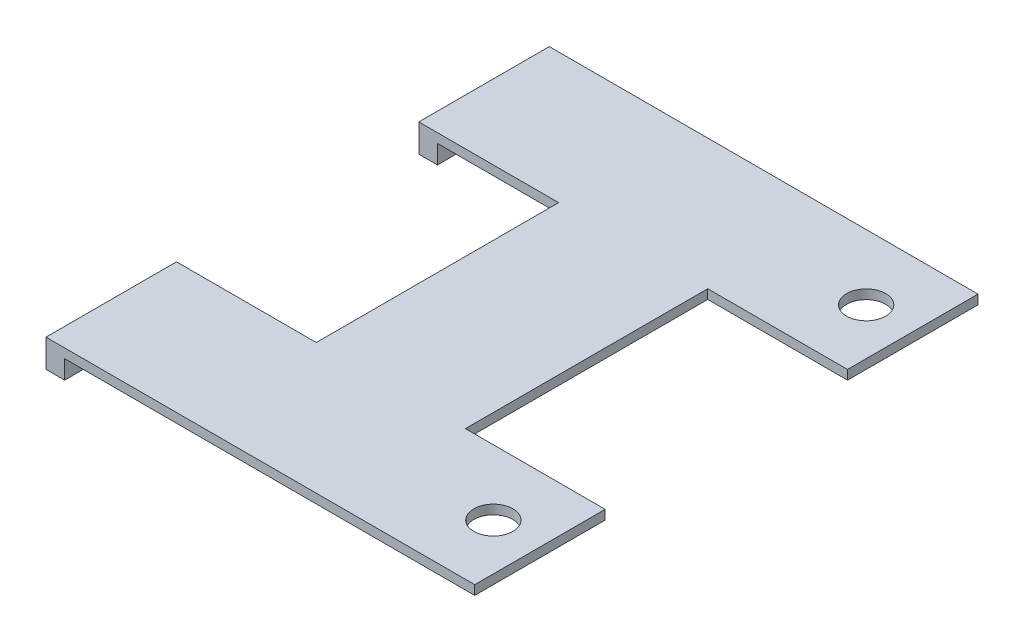
ISO-10303-21;
HEADER;
FILE_DESCRIPTION(('STEP AP214'),'2;1');
FILE_NAME('part.step','',(''),(''),'','','');
FILE_SCHEMA(('AUTOMOTIVE_DESIGN { 1 0 10303 214 1 1 1 1 }'));
ENDSEC;
DATA;
#1=APPLICATION_CONTEXT('core data for automotive mechanical design processes');
#2=APPLICATION_PROTOCOL_DEFINITION('international standard','automotive_design',2000,#1);
#3=PRODUCT_CONTEXT('',#1,'mechanical');
#4=PRODUCT('Part','Part','',(#3));
#5=PRODUCT_RELATED_PRODUCT_CATEGORY('part','',(#4));
#6=PRODUCT_DEFINITION_FORMATION('','',#4);
#7=PRODUCT_DEFINITION_CONTEXT('part definition',#1,'design');
#8=PRODUCT_DEFINITION('design','',#6,#7);
#9=PRODUCT_DEFINITION_SHAPE('','',#8);
#10=(LENGTH_UNIT() NAMED_UNIT(*) SI_UNIT(.MILLI.,.METRE.));
#11=(NAMED_UNIT(*) PLANE_ANGLE_UNIT() SI_UNIT($,.RADIAN.));
#12=(NAMED_UNIT(*) SI_UNIT($,.STERADIAN.) SOLID_ANGLE_UNIT());
#13=UNCERTAINTY_MEASURE_WITH_UNIT(LENGTH_MEASURE(1.E-05),#10,'distance_accuracy_value','');
#14=(GEOMETRIC_REPRESENTATION_CONTEXT(3) GLOBAL_UNCERTAINTY_ASSIGNED_CONTEXT((#13)) GLOBAL_UNIT_ASSIGNED_CONTEXT((#10,
#11,#12)) REPRESENTATION_CONTEXT('',''));
#15=CARTESIAN_POINT('',(0.,0.,0.));
#16=DIRECTION('',(0.,0.,1.));
#17=DIRECTION('',(1.,0.,0.));
#18=AXIS2_PLACEMENT_3D('',#15,#16,#17);
#19=CARTESIAN_POINT('',(0.,0.,0.));
#20=DIRECTION('',(0.,-1.,0.));
#21=DIRECTION('',(0.,0.,-1.));
#22=AXIS2_PLACEMENT_3D('',#19,#20,#21);
#23=PLANE('',#22);
#24=CARTESIAN_POINT('',(-35.5516147708673,0.,132.360414745423));
#25=DIRECTION('',(0.,1.,0.));
#26=DIRECTION('',(0.,0.,1.));
#27=AXIS2_PLACEMENT_3D('',#24,#25,#26);
#28=CIRCLE('',#27,2.10000000000004);
#29=CARTESIAN_POINT('',(-35.5516147708673,0.,134.460414745423));
#30=VERTEX_POINT('',#29);
#31=EDGE_CURVE('E225',#30,#30,#28,.T.);
#32=ORIENTED_EDGE('',*,*,#31,.T.);
#33=EDGE_LOOP('',(#32));
#34=FACE_BOUND('',#33,.T.);
#35=CARTESIAN_POINT('',(-35.5516147708674,0.,172.360414745423));
#36=DIRECTION('',(0.,1.,0.));
#37=DIRECTION('',(0.,0.,1.));
#38=AXIS2_PLACEMENT_3D('',#35,#36,#37);
#39=CIRCLE('',#38,2.09999999999999);
#40=CARTESIAN_POINT('',(-35.5516147708674,0.,174.460414745423));
#41=VERTEX_POINT('',#40);
#42=EDGE_CURVE('E220',#41,#41,#39,.T.);
#43=ORIENTED_EDGE('',*,*,#42,.T.);
#44=EDGE_LOOP('',(#43));
#45=FACE_BOUND('',#44,.T.);
#46=DIRECTION('',(1.,0.,0.));
#47=VECTOR('',#46,1.);
#48=CARTESIAN_POINT('',(-76.5516147708674,0.,139.360414745423));
#49=LINE('',#48,#47);
#50=CARTESIAN_POINT('',(-74.5516147708674,0.,139.360414745423));
#51=VERTEX_POINT('',#50);
#52=CARTESIAN_POINT('',(-61.5516147708674,0.,139.360414745423));
#53=VERTEX_POINT('',#52);
#54=EDGE_CURVE('E293',#51,#53,#49,.T.);
#55=ORIENTED_EDGE('',*,*,#54,.F.);
#56=DIRECTION('',(0.,0.,1.));
#57=VECTOR('',#56,1.);
#58=CARTESIAN_POINT('',(-74.5516147708674,0.,139.360414745423));
#59=LINE('',#58,#57);
#60=CARTESIAN_POINT('',(-74.5516147708674,0.,125.360414745423));
#61=VERTEX_POINT('',#60);
#62=EDGE_CURVE('E183',#61,#51,#59,.T.);
#63=ORIENTED_EDGE('',*,*,#62,.F.);
#64=DIRECTION('',(-1.,0.,0.));
#65=VECTOR('',#64,1.);
#66=CARTESIAN_POINT('',(-30.5516147708673,0.,125.360414745423));
#67=LINE('',#66,#65);
#68=CARTESIAN_POINT('',(-30.5516147708673,0.,125.360414745423));
#69=VERTEX_POINT('',#68);
#70=EDGE_CURVE('E290',#69,#61,#67,.T.);
#71=ORIENTED_EDGE('',*,*,#70,.F.);
#72=DIRECTION('',(0.,0.,-1.));
#73=VECTOR('',#72,1.);
#74=CARTESIAN_POINT('',(-30.5516147708673,0.,125.360414745423));
#75=LINE('',#74,#73);
#76=CARTESIAN_POINT('',(-30.5516147708673,0.,139.360414745423));
#77=VERTEX_POINT('',#76);
#78=EDGE_CURVE('E287',#77,#69,#75,.T.);
#79=ORIENTED_EDGE('',*,*,#78,.F.);
#80=DIRECTION('',(1.,0.,0.));
#81=VECTOR('',#80,1.);
#82=CARTESIAN_POINT('',(-30.5516147708673,0.,139.360414745423));
#83=LINE('',#82,#81);
#84=CARTESIAN_POINT('',(-45.5516147708673,0.,139.360414745423));
#85=VERTEX_POINT('',#84);
#86=EDGE_CURVE('E284',#85,#77,#83,.T.);
#87=ORIENTED_EDGE('',*,*,#86,.F.);
#88=DIRECTION('',(0.,0.,-1.));
#89=VECTOR('',#88,1.);
#90=CARTESIAN_POINT('',(-45.5516147708673,0.,139.360414745423));
#91=LINE('',#90,#89);
#92=CARTESIAN_POINT('',(-45.5516147708673,0.,165.360414745423));
#93=VERTEX_POINT('',#92);
#94=EDGE_CURVE('E281',#93,#85,#91,.T.);
#95=ORIENTED_EDGE('',*,*,#94,.F.);
#96=DIRECTION('',(-1.,0.,0.));
#97=VECTOR('',#96,1.);
#98=CARTESIAN_POINT('',(-30.5516147708673,0.,165.360414745423));
#99=LINE('',#98,#97);
#100=CARTESIAN_POINT('',(-30.5516147708673,0.,165.360414745423));
#101=VERTEX_POINT('',#100);
#102=EDGE_CURVE('E278',#101,#93,#99,.T.);
#103=ORIENTED_EDGE('',*,*,#102,.F.);
#104=DIRECTION('',(0.,0.,-1.));
#105=VECTOR('',#104,1.);
#106=CARTESIAN_POINT('',(-30.5516147708673,0.,165.360414745423));
#107=LINE('',#106,#105);
#108=CARTESIAN_POINT('',(-30.5516147708673,0.,179.360414745423));
#109=VERTEX_POINT('',#108);
#110=EDGE_CURVE('E233',#109,#101,#107,.T.);
#111=ORIENTED_EDGE('',*,*,#110,.F.);
#112=DIRECTION('',(1.,0.,0.));
#113=VECTOR('',#112,1.);
#114=CARTESIAN_POINT('',(-30.5516147708673,0.,179.360414745423));
#115=LINE('',#114,#113);
#116=CARTESIAN_POINT('',(-74.5516147708674,0.,179.360414745423));
#117=VERTEX_POINT('',#116);
#118=EDGE_CURVE('E242',#117,#109,#115,.T.);
#119=ORIENTED_EDGE('',*,*,#118,.F.);
#120=DIRECTION('',(0.,0.,1.));
#121=VECTOR('',#120,1.);
#122=CARTESIAN_POINT('',(-74.5516147708674,0.,179.360414745423));
#123=LINE('',#122,#121);
#124=CARTESIAN_POINT('',(-74.5516147708674,0.,165.360414745423));
#125=VERTEX_POINT('',#124);
#126=EDGE_CURVE('E63',#125,#117,#123,.T.);
#127=ORIENTED_EDGE('',*,*,#126,.F.);
#128=DIRECTION('',(-1.,0.,0.));
#129=VECTOR('',#128,1.);
#130=CARTESIAN_POINT('',(-76.5516147708674,0.,165.360414745423));
#131=LINE('',#130,#129);
#132=CARTESIAN_POINT('',(-61.5516147708674,0.,165.360414745423));
#133=VERTEX_POINT('',#132);
#134=EDGE_CURVE('E299',#133,#125,#131,.T.);
#135=ORIENTED_EDGE('',*,*,#134,.F.);
#136=DIRECTION('',(0.,0.,1.));
#137=VECTOR('',#136,1.);
#138=CARTESIAN_POINT('',(-61.5516147708674,0.,139.360414745423));
#139=LINE('',#138,#137);
#140=EDGE_CURVE('E296',#53,#133,#139,.T.);
#141=ORIENTED_EDGE('',*,*,#140,.F.);
#142=EDGE_LOOP('',(#55,#63,#71,#79,#87,#95,#103,#111,#119,#127,#135,#141));
#143=FACE_BOUND('',#142,.T.);
#144=ADVANCED_FACE('F39',(#34,#45,#143),#23,.T.);
#145=CARTESIAN_POINT('',(0.,1.,0.));
#146=DIRECTION('',(0.,-1.,0.));
#147=DIRECTION('',(0.,0.,-1.));
#148=AXIS2_PLACEMENT_3D('',#145,#146,#147);
#149=PLANE('',#148);
#150=DIRECTION('',(0.,0.,-1.));
#151=VECTOR('',#150,1.);
#152=CARTESIAN_POINT('',(-30.5516147708673,1.,165.360414745423));
#153=LINE('',#152,#151);
#154=CARTESIAN_POINT('',(-30.5516147708673,1.,179.360414745423));
#155=VERTEX_POINT('',#154);
#156=CARTESIAN_POINT('',(-30.5516147708673,1.,165.360414745423));
#157=VERTEX_POINT('',#156);
#158=EDGE_CURVE('E237',#155,#157,#153,.T.);
#159=ORIENTED_EDGE('',*,*,#158,.T.);
#160=DIRECTION('',(-1.,0.,0.));
#161=VECTOR('',#160,1.);
#162=CARTESIAN_POINT('',(-30.5516147708673,1.,165.360414745423));
#163=LINE('',#162,#161);
#164=CARTESIAN_POINT('',(-45.5516147708673,1.,165.360414745423));
#165=VERTEX_POINT('',#164);
#166=EDGE_CURVE('E241',#157,#165,#163,.T.);
#167=ORIENTED_EDGE('',*,*,#166,.T.);
#168=DIRECTION('',(0.,0.,-1.));
#169=VECTOR('',#168,1.);
#170=CARTESIAN_POINT('',(-45.5516147708673,1.,139.360414745423));
#171=LINE('',#170,#169);
#172=CARTESIAN_POINT('',(-45.5516147708673,1.,139.360414745423));
#173=VERTEX_POINT('',#172);
#174=EDGE_CURVE('E245',#165,#173,#171,.T.);
#175=ORIENTED_EDGE('',*,*,#174,.T.);
#176=DIRECTION('',(1.,0.,0.));
#177=VECTOR('',#176,1.);
#178=CARTESIAN_POINT('',(-30.5516147708673,1.,139.360414745423));
#179=LINE('',#178,#177);
#180=CARTESIAN_POINT('',(-30.5516147708673,1.,139.360414745423));
#181=VERTEX_POINT('',#180);
#182=EDGE_CURVE('E248',#173,#181,#179,.T.);
#183=ORIENTED_EDGE('',*,*,#182,.T.);
#184=DIRECTION('',(0.,0.,-1.));
#185=VECTOR('',#184,1.);
#186=CARTESIAN_POINT('',(-30.5516147708673,1.,125.360414745423));
#187=LINE('',#186,#185);
#188=CARTESIAN_POINT('',(-30.5516147708673,1.,125.360414745423));
#189=VERTEX_POINT('',#188);
#190=EDGE_CURVE('E251',#181,#189,#187,.T.);
#191=ORIENTED_EDGE('',*,*,#190,.T.);
#192=DIRECTION('',(-1.,0.,0.));
#193=VECTOR('',#192,1.);
#194=CARTESIAN_POINT('',(-30.5516147708673,1.,125.360414745423));
#195=LINE('',#194,#193);
#196=CARTESIAN_POINT('',(-76.5516147708674,1.,125.360414745423));
#197=VERTEX_POINT('',#196);
#198=EDGE_CURVE('E254',#189,#197,#195,.T.);
#199=ORIENTED_EDGE('',*,*,#198,.T.);
#200=DIRECTION('',(0.,0.,1.));
#201=VECTOR('',#200,1.);
#202=CARTESIAN_POINT('',(-76.5516147708674,1.,125.360414745423));
#203=LINE('',#202,#201);
#204=CARTESIAN_POINT('',(-76.5516147708674,1.,139.360414745423));
#205=VERTEX_POINT('',#204);
#206=EDGE_CURVE('E162',#197,#205,#203,.T.);
#207=ORIENTED_EDGE('',*,*,#206,.T.);
#208=DIRECTION('',(1.,0.,0.));
#209=VECTOR('',#208,1.);
#210=CARTESIAN_POINT('',(-76.5516147708674,1.,139.360414745423));
#211=LINE('',#210,#209);
#212=CARTESIAN_POINT('',(-61.5516147708674,1.,139.360414745423));
#213=VERTEX_POINT('',#212);
#214=EDGE_CURVE('E259',#205,#213,#211,.T.);
#215=ORIENTED_EDGE('',*,*,#214,.T.);
#216=DIRECTION('',(0.,0.,1.));
#217=VECTOR('',#216,1.);
#218=CARTESIAN_POINT('',(-61.5516147708674,1.,139.360414745423));
#219=LINE('',#218,#217);
#220=CARTESIAN_POINT('',(-61.5516147708674,1.,165.360414745423));
#221=VERTEX_POINT('',#220);
#222=EDGE_CURVE('E262',#213,#221,#219,.T.);
#223=ORIENTED_EDGE('',*,*,#222,.T.);
#224=DIRECTION('',(-1.,0.,0.));
#225=VECTOR('',#224,1.);
#226=CARTESIAN_POINT('',(-76.5516147708674,1.,165.360414745423));
#227=LINE('',#226,#225);
#228=CARTESIAN_POINT('',(-76.5516147708674,1.,165.360414745423));
#229=VERTEX_POINT('',#228);
#230=EDGE_CURVE('E265',#221,#229,#227,.T.);
#231=ORIENTED_EDGE('',*,*,#230,.T.);
#232=DIRECTION('',(0.,0.,1.));
#233=VECTOR('',#232,1.);
#234=CARTESIAN_POINT('',(-76.5516147708674,1.,165.360414745423));
#235=LINE('',#234,#233);
#236=CARTESIAN_POINT('',(-76.5516147708674,1.,179.360414745423));
#237=VERTEX_POINT('',#236);
#238=EDGE_CURVE('E268',#229,#237,#235,.T.);
#239=ORIENTED_EDGE('',*,*,#238,.T.);
#240=DIRECTION('',(1.,0.,0.));
#241=VECTOR('',#240,1.);
#242=CARTESIAN_POINT('',(-30.5516147708673,1.,179.360414745423));
#243=LINE('',#242,#241);
#244=EDGE_CURVE('E271',#237,#155,#243,.T.);
#245=ORIENTED_EDGE('',*,*,#244,.T.);
#246=EDGE_LOOP('',(#159,#167,#175,#183,#191,#199,#207,#215,#223,#231,#239,#245));
#247=FACE_BOUND('',#246,.T.);
#248=CARTESIAN_POINT('',(-35.5516147708673,1.,132.360414745423));
#249=DIRECTION('',(0.,1.,0.));
#250=DIRECTION('',(0.,0.,1.));
#251=AXIS2_PLACEMENT_3D('',#248,#249,#250);
#252=CIRCLE('',#251,2.10000000000004);
#253=CARTESIAN_POINT('',(-35.5516147708673,1.,134.460414745423));
#254=VERTEX_POINT('',#253);
#255=EDGE_CURVE('E229',#254,#254,#252,.T.);
#256=ORIENTED_EDGE('',*,*,#255,.F.);
#257=EDGE_LOOP('',(#256));
#258=FACE_BOUND('',#257,.T.);
#259=CARTESIAN_POINT('',(-35.5516147708674,1.,172.360414745423));
#260=DIRECTION('',(0.,1.,0.));
#261=DIRECTION('',(0.,0.,1.));
#262=AXIS2_PLACEMENT_3D('',#259,#260,#261);
#263=CIRCLE('',#262,2.09999999999999);
#264=CARTESIAN_POINT('',(-35.5516147708674,1.,174.460414745423));
#265=VERTEX_POINT('',#264);
#266=EDGE_CURVE('E221',#265,#265,#263,.T.);
#267=ORIENTED_EDGE('',*,*,#266,.F.);
#268=EDGE_LOOP('',(#267));
#269=FACE_BOUND('',#268,.T.);
#270=ADVANCED_FACE('F356',(#247,#258,#269),#149,.F.);
#271=CARTESIAN_POINT('',(-30.5516147708673,1.,165.360414745423));
#272=DIRECTION('',(-1.,0.,0.));
#273=DIRECTION('',(0.,0.,1.));
#274=AXIS2_PLACEMENT_3D('',#271,#272,#273);
#275=PLANE('',#274);
#276=ORIENTED_EDGE('',*,*,#110,.T.);
#277=DIRECTION('',(0.,-1.,0.));
#278=VECTOR('',#277,1.);
#279=CARTESIAN_POINT('',(-30.5516147708673,1.,165.360414745423));
#280=LINE('',#279,#278);
#281=EDGE_CURVE('E11',#157,#101,#280,.T.);
#282=ORIENTED_EDGE('',*,*,#281,.F.);
#283=ORIENTED_EDGE('',*,*,#158,.F.);
#284=DIRECTION('',(0.,-1.,0.));
#285=VECTOR('',#284,1.);
#286=CARTESIAN_POINT('',(-30.5516147708673,1.,179.360414745423));
#287=LINE('',#286,#285);
#288=EDGE_CURVE('E274',#155,#109,#287,.T.);
#289=ORIENTED_EDGE('',*,*,#288,.T.);
#290=EDGE_LOOP('',(#276,#282,#283,#289));
#291=FACE_BOUND('',#290,.T.);
#292=ADVANCED_FACE('F41',(#291),#275,.F.);
#293=CARTESIAN_POINT('',(-30.5516147708673,1.,165.360414745423));
#294=DIRECTION('',(0.,0.,1.));
#295=DIRECTION('',(1.,0.,0.));
#296=AXIS2_PLACEMENT_3D('',#293,#294,#295);
#297=PLANE('',#296);
#298=ORIENTED_EDGE('',*,*,#102,.T.);
#299=DIRECTION('',(0.,-1.,0.));
#300=VECTOR('',#299,1.);
#301=CARTESIAN_POINT('',(-45.5516147708673,1.,165.360414745423));
#302=LINE('',#301,#300);
#303=EDGE_CURVE('E48',#165,#93,#302,.T.);
#304=ORIENTED_EDGE('',*,*,#303,.F.);
#305=ORIENTED_EDGE('',*,*,#166,.F.);
#306=ORIENTED_EDGE('',*,*,#281,.T.);
#307=EDGE_LOOP('',(#298,#304,#305,#306));
#308=FACE_BOUND('',#307,.T.);
#309=ADVANCED_FACE('F360',(#308),#297,.F.);
#310=CARTESIAN_POINT('',(-45.5516147708673,1.,139.360414745423));
#311=DIRECTION('',(-1.,0.,0.));
#312=DIRECTION('',(0.,0.,1.));
#313=AXIS2_PLACEMENT_3D('',#310,#311,#312);
#314=PLANE('',#313);
#315=ORIENTED_EDGE('',*,*,#94,.T.);
#316=DIRECTION('',(0.,-1.,0.));
#317=VECTOR('',#316,1.);
#318=CARTESIAN_POINT('',(-45.5516147708673,1.,139.360414745423));
#319=LINE('',#318,#317);
#320=EDGE_CURVE('E330',#173,#85,#319,.T.);
#321=ORIENTED_EDGE('',*,*,#320,.F.);
#322=ORIENTED_EDGE('',*,*,#174,.F.);
#323=ORIENTED_EDGE('',*,*,#303,.T.);
#324=EDGE_LOOP('',(#315,#321,#322,#323));
#325=FACE_BOUND('',#324,.T.);
#326=ADVANCED_FACE('F339',(#325),#314,.F.);
#327=CARTESIAN_POINT('',(-30.5516147708673,1.,139.360414745423));
#328=DIRECTION('',(0.,0.,-1.));
#329=DIRECTION('',(-1.,0.,0.));
#330=AXIS2_PLACEMENT_3D('',#327,#328,#329);
#331=PLANE('',#330);
#332=ORIENTED_EDGE('',*,*,#86,.T.);
#333=DIRECTION('',(0.,-1.,0.));
#334=VECTOR('',#333,1.);
#335=CARTESIAN_POINT('',(-30.5516147708673,1.,139.360414745423));
#336=LINE('',#335,#334);
#337=EDGE_CURVE('E326',#181,#77,#336,.T.);
#338=ORIENTED_EDGE('',*,*,#337,.F.);
#339=ORIENTED_EDGE('',*,*,#182,.F.);
#340=ORIENTED_EDGE('',*,*,#320,.T.);
#341=EDGE_LOOP('',(#332,#338,#339,#340));
#342=FACE_BOUND('',#341,.T.);
#343=ADVANCED_FACE('F349',(#342),#331,.F.);
#344=CARTESIAN_POINT('',(-30.5516147708673,1.,125.360414745423));
#345=DIRECTION('',(-1.,0.,0.));
#346=DIRECTION('',(0.,0.,1.));
#347=AXIS2_PLACEMENT_3D('',#344,#345,#346);
#348=PLANE('',#347);
#349=ORIENTED_EDGE('',*,*,#78,.T.);
#350=DIRECTION('',(0.,-1.,0.));
#351=VECTOR('',#350,1.);
#352=CARTESIAN_POINT('',(-30.5516147708673,1.,125.360414745423));
#353=LINE('',#352,#351);
#354=EDGE_CURVE('E166',#189,#69,#353,.T.);
#355=ORIENTED_EDGE('',*,*,#354,.F.);
#356=ORIENTED_EDGE('',*,*,#190,.F.);
#357=ORIENTED_EDGE('',*,*,#337,.T.);
#358=EDGE_LOOP('',(#349,#355,#356,#357));
#359=FACE_BOUND('',#358,.T.);
#360=ADVANCED_FACE('F353',(#359),#348,.F.);
#361=CARTESIAN_POINT('',(-30.5516147708673,1.,125.360414745423));
#362=DIRECTION('',(0.,0.,1.));
#363=DIRECTION('',(1.,0.,0.));
#364=AXIS2_PLACEMENT_3D('',#361,#362,#363);
#365=PLANE('',#364);
#366=ORIENTED_EDGE('',*,*,#70,.T.);
#367=DIRECTION('',(0.,1.,0.));
#368=VECTOR('',#367,1.);
#369=CARTESIAN_POINT('',(-74.5516147708674,-2.,125.360414745423));
#370=LINE('',#369,#368);
#371=CARTESIAN_POINT('',(-74.5516147708674,-2.,125.360414745423));
#372=VERTEX_POINT('',#371);
#373=EDGE_CURVE('E173',#372,#61,#370,.T.);
#374=ORIENTED_EDGE('',*,*,#373,.F.);
#375=DIRECTION('',(1.,0.,0.));
#376=VECTOR('',#375,1.);
#377=CARTESIAN_POINT('',(-76.5516147708674,-2.,125.360414745423));
#378=LINE('',#377,#376);
#379=CARTESIAN_POINT('',(-76.5516147708674,-2.,125.360414745423));
#380=VERTEX_POINT('',#379);
#381=EDGE_CURVE('E170',#380,#372,#378,.T.);
#382=ORIENTED_EDGE('',*,*,#381,.F.);
#383=DIRECTION('',(0.,-1.,0.));
#384=VECTOR('',#383,1.);
#385=CARTESIAN_POINT('',(-76.5516147708674,1.,125.360414745423));
#386=LINE('',#385,#384);
#387=EDGE_CURVE('E156',#197,#380,#386,.T.);
#388=ORIENTED_EDGE('',*,*,#387,.F.);
#389=ORIENTED_EDGE('',*,*,#198,.F.);
#390=ORIENTED_EDGE('',*,*,#354,.T.);
#391=EDGE_LOOP('',(#366,#374,#382,#388,#389,#390));
#392=FACE_BOUND('',#391,.T.);
#393=ADVANCED_FACE('F172',(#392),#365,.F.);
#394=CARTESIAN_POINT('',(-76.5516147708674,1.,125.360414745423));
#395=DIRECTION('',(1.,0.,0.));
#396=DIRECTION('',(0.,0.,-1.));
#397=AXIS2_PLACEMENT_3D('',#394,#395,#396);
#398=PLANE('',#397);
#399=ORIENTED_EDGE('',*,*,#387,.T.);
#400=DIRECTION('',(0.,0.,-1.));
#401=VECTOR('',#400,1.);
#402=CARTESIAN_POINT('',(-76.5516147708674,-2.,139.360414745423));
#403=LINE('',#402,#401);
#404=CARTESIAN_POINT('',(-76.5516147708674,-2.,139.360414745423));
#405=VERTEX_POINT('',#404);
#406=EDGE_CURVE('E161',#405,#380,#403,.T.);
#407=ORIENTED_EDGE('',*,*,#406,.F.);
#408=DIRECTION('',(0.,-1.,0.));
#409=VECTOR('',#408,1.);
#410=CARTESIAN_POINT('',(-76.5516147708674,1.,139.360414745423));
#411=LINE('',#410,#409);
#412=EDGE_CURVE('E167',#205,#405,#411,.T.);
#413=ORIENTED_EDGE('',*,*,#412,.F.);
#414=ORIENTED_EDGE('',*,*,#206,.F.);
#415=EDGE_LOOP('',(#399,#407,#413,#414));
#416=FACE_BOUND('',#415,.T.);
#417=ADVANCED_FACE('F158',(#416),#398,.F.);
#418=CARTESIAN_POINT('',(-76.5516147708674,1.,139.360414745423));
#419=DIRECTION('',(0.,0.,-1.));
#420=DIRECTION('',(-1.,0.,0.));
#421=AXIS2_PLACEMENT_3D('',#418,#419,#420);
#422=PLANE('',#421);
#423=ORIENTED_EDGE('',*,*,#412,.T.);
#424=DIRECTION('',(-1.,0.,0.));
#425=VECTOR('',#424,1.);
#426=CARTESIAN_POINT('',(-76.5516147708674,-2.,139.360414745423));
#427=LINE('',#426,#425);
#428=CARTESIAN_POINT('',(-74.5516147708674,-2.,139.360414745423));
#429=VERTEX_POINT('',#428);
#430=EDGE_CURVE('E181',#429,#405,#427,.T.);
#431=ORIENTED_EDGE('',*,*,#430,.F.);
#432=DIRECTION('',(0.,1.,0.));
#433=VECTOR('',#432,1.);
#434=CARTESIAN_POINT('',(-74.5516147708674,-2.,139.360414745423));
#435=LINE('',#434,#433);
#436=EDGE_CURVE('E55',#429,#51,#435,.T.);
#437=ORIENTED_EDGE('',*,*,#436,.T.);
#438=ORIENTED_EDGE('',*,*,#54,.T.);
#439=DIRECTION('',(0.,-1.,0.));
#440=VECTOR('',#439,1.);
#441=CARTESIAN_POINT('',(-61.5516147708674,1.,139.360414745423));
#442=LINE('',#441,#440);
#443=EDGE_CURVE('E317',#213,#53,#442,.T.);
#444=ORIENTED_EDGE('',*,*,#443,.F.);
#445=ORIENTED_EDGE('',*,*,#214,.F.);
#446=EDGE_LOOP('',(#423,#431,#437,#438,#444,#445));
#447=FACE_BOUND('',#446,.T.);
#448=ADVANCED_FACE('F392',(#447),#422,.F.);
#449=CARTESIAN_POINT('',(-61.5516147708674,1.,139.360414745423));
#450=DIRECTION('',(1.,0.,0.));
#451=DIRECTION('',(0.,0.,-1.));
#452=AXIS2_PLACEMENT_3D('',#449,#450,#451);
#453=PLANE('',#452);
#454=ORIENTED_EDGE('',*,*,#140,.T.);
#455=DIRECTION('',(0.,-1.,0.));
#456=VECTOR('',#455,1.);
#457=CARTESIAN_POINT('',(-61.5516147708674,1.,165.360414745423));
#458=LINE('',#457,#456);
#459=EDGE_CURVE('E313',#221,#133,#458,.T.);
#460=ORIENTED_EDGE('',*,*,#459,.F.);
#461=ORIENTED_EDGE('',*,*,#222,.F.);
#462=ORIENTED_EDGE('',*,*,#443,.T.);
#463=EDGE_LOOP('',(#454,#460,#461,#462));
#464=FACE_BOUND('',#463,.T.);
#465=ADVANCED_FACE('F388',(#464),#453,.F.);
#466=CARTESIAN_POINT('',(-76.5516147708674,1.,165.360414745423));
#467=DIRECTION('',(0.,0.,1.));
#468=DIRECTION('',(1.,0.,0.));
#469=AXIS2_PLACEMENT_3D('',#466,#467,#468);
#470=PLANE('',#469);
#471=ORIENTED_EDGE('',*,*,#134,.T.);
#472=DIRECTION('',(0.,1.,0.));
#473=VECTOR('',#472,1.);
#474=CARTESIAN_POINT('',(-74.5516147708674,-2.,165.360414745423));
#475=LINE('',#474,#473);
#476=CARTESIAN_POINT('',(-74.5516147708674,-2.,165.360414745423));
#477=VERTEX_POINT('',#476);
#478=EDGE_CURVE('E216',#477,#125,#475,.T.);
#479=ORIENTED_EDGE('',*,*,#478,.F.);
#480=DIRECTION('',(1.,0.,0.));
#481=VECTOR('',#480,1.);
#482=CARTESIAN_POINT('',(-76.5516147708674,-2.,165.360414745423));
#483=LINE('',#482,#481);
#484=CARTESIAN_POINT('',(-76.5516147708674,-2.,165.360414745423));
#485=VERTEX_POINT('',#484);
#486=EDGE_CURVE('E200',#485,#477,#483,.T.);
#487=ORIENTED_EDGE('',*,*,#486,.F.);
#488=DIRECTION('',(0.,-1.,0.));
#489=VECTOR('',#488,1.);
#490=CARTESIAN_POINT('',(-76.5516147708674,1.,165.360414745423));
#491=LINE('',#490,#489);
#492=EDGE_CURVE('E310',#229,#485,#491,.T.);
#493=ORIENTED_EDGE('',*,*,#492,.F.);
#494=ORIENTED_EDGE('',*,*,#230,.F.);
#495=ORIENTED_EDGE('',*,*,#459,.T.);
#496=EDGE_LOOP('',(#471,#479,#487,#493,#494,#495));
#497=FACE_BOUND('',#496,.T.);
#498=ADVANCED_FACE('F383',(#497),#470,.F.);
#499=CARTESIAN_POINT('',(-76.5516147708674,1.,165.360414745423));
#500=DIRECTION('',(1.,0.,0.));
#501=DIRECTION('',(0.,0.,-1.));
#502=AXIS2_PLACEMENT_3D('',#499,#500,#501);
#503=PLANE('',#502);
#504=ORIENTED_EDGE('',*,*,#492,.T.);
#505=DIRECTION('',(0.,0.,-1.));
#506=VECTOR('',#505,1.);
#507=CARTESIAN_POINT('',(-76.5516147708674,-2.,179.360414745423));
#508=LINE('',#507,#506);
#509=CARTESIAN_POINT('',(-76.5516147708674,-2.,179.360414745423));
#510=VERTEX_POINT('',#509);
#511=EDGE_CURVE('E196',#510,#485,#508,.T.);
#512=ORIENTED_EDGE('',*,*,#511,.F.);
#513=DIRECTION('',(0.,-1.,0.));
#514=VECTOR('',#513,1.);
#515=CARTESIAN_POINT('',(-76.5516147708674,1.,179.360414745423));
#516=LINE('',#515,#514);
#517=EDGE_CURVE('E307',#237,#510,#516,.T.);
#518=ORIENTED_EDGE('',*,*,#517,.F.);
#519=ORIENTED_EDGE('',*,*,#238,.F.);
#520=EDGE_LOOP('',(#504,#512,#518,#519));
#521=FACE_BOUND('',#520,.T.);
#522=ADVANCED_FACE('F377',(#521),#503,.F.);
#523=CARTESIAN_POINT('',(-30.5516147708673,1.,179.360414745423));
#524=DIRECTION('',(0.,0.,-1.));
#525=DIRECTION('',(-1.,0.,0.));
#526=AXIS2_PLACEMENT_3D('',#523,#524,#525);
#527=PLANE('',#526);
#528=ORIENTED_EDGE('',*,*,#517,.T.);
#529=DIRECTION('',(-1.,0.,0.));
#530=VECTOR('',#529,1.);
#531=CARTESIAN_POINT('',(-76.5516147708674,-2.,179.360414745423));
#532=LINE('',#531,#530);
#533=CARTESIAN_POINT('',(-74.5516147708674,-2.,179.360414745423));
#534=VERTEX_POINT('',#533);
#535=EDGE_CURVE('E206',#534,#510,#532,.T.);
#536=ORIENTED_EDGE('',*,*,#535,.F.);
#537=DIRECTION('',(0.,1.,0.));
#538=VECTOR('',#537,1.);
#539=CARTESIAN_POINT('',(-74.5516147708674,-2.,179.360414745423));
#540=LINE('',#539,#538);
#541=EDGE_CURVE('E210',#534,#117,#540,.T.);
#542=ORIENTED_EDGE('',*,*,#541,.T.);
#543=ORIENTED_EDGE('',*,*,#118,.T.);
#544=ORIENTED_EDGE('',*,*,#288,.F.);
#545=ORIENTED_EDGE('',*,*,#244,.F.);
#546=EDGE_LOOP('',(#528,#536,#542,#543,#544,#545));
#547=FACE_BOUND('',#546,.T.);
#548=ADVANCED_FACE('F370',(#547),#527,.F.);
#549=CARTESIAN_POINT('',(-35.5516147708673,1.,132.360414745423));
#550=DIRECTION('',(0.,-1.,0.));
#551=DIRECTION('',(0.,0.,-1.));
#552=AXIS2_PLACEMENT_3D('',#549,#550,#551);
#553=CYLINDRICAL_SURFACE('',#552,2.10000000000004);
#554=ORIENTED_EDGE('',*,*,#255,.T.);
#555=EDGE_LOOP('',(#554));
#556=FACE_BOUND('',#555,.T.);
#557=ORIENTED_EDGE('',*,*,#31,.F.);
#558=EDGE_LOOP('',(#557));
#559=FACE_BOUND('',#558,.T.);
#560=ADVANCED_FACE('F413',(#556,#559),#553,.F.);
#561=CARTESIAN_POINT('',(-35.5516147708674,1.,172.360414745423));
#562=DIRECTION('',(0.,-1.,0.));
#563=DIRECTION('',(0.,0.,-1.));
#564=AXIS2_PLACEMENT_3D('',#561,#562,#563);
#565=CYLINDRICAL_SURFACE('',#564,2.09999999999999);
#566=ORIENTED_EDGE('',*,*,#266,.T.);
#567=EDGE_LOOP('',(#566));
#568=FACE_BOUND('',#567,.T.);
#569=ORIENTED_EDGE('',*,*,#42,.F.);
#570=EDGE_LOOP('',(#569));
#571=FACE_BOUND('',#570,.T.);
#572=ADVANCED_FACE('F436',(#568,#571),#565,.F.);
#573=CARTESIAN_POINT('',(-74.5516147708674,-2.,179.360414745423));
#574=DIRECTION('',(-1.,0.,0.));
#575=DIRECTION('',(0.,0.,1.));
#576=AXIS2_PLACEMENT_3D('',#573,#574,#575);
#577=PLANE('',#576);
#578=ORIENTED_EDGE('',*,*,#126,.T.);
#579=ORIENTED_EDGE('',*,*,#541,.F.);
#580=DIRECTION('',(0.,0.,1.));
#581=VECTOR('',#580,1.);
#582=CARTESIAN_POINT('',(-74.5516147708674,-2.,179.360414745423));
#583=LINE('',#582,#581);
#584=EDGE_CURVE('E203',#477,#534,#583,.T.);
#585=ORIENTED_EDGE('',*,*,#584,.F.);
#586=ORIENTED_EDGE('',*,*,#478,.T.);
#587=EDGE_LOOP('',(#578,#579,#585,#586));
#588=FACE_BOUND('',#587,.T.);
#589=ADVANCED_FACE('F366',(#588),#577,.F.);
#590=CARTESIAN_POINT('',(0.,-2.,0.));
#591=DIRECTION('',(0.,-1.,0.));
#592=DIRECTION('',(0.,0.,-1.));
#593=AXIS2_PLACEMENT_3D('',#590,#591,#592);
#594=PLANE('',#593);
#595=ORIENTED_EDGE('',*,*,#511,.T.);
#596=ORIENTED_EDGE('',*,*,#486,.T.);
#597=ORIENTED_EDGE('',*,*,#584,.T.);
#598=ORIENTED_EDGE('',*,*,#535,.T.);
#599=EDGE_LOOP('',(#595,#596,#597,#598));
#600=FACE_BOUND('',#599,.T.);
#601=ADVANCED_FACE('F375',(#600),#594,.T.);
#602=CARTESIAN_POINT('',(-74.5516147708674,-2.,139.360414745423));
#603=DIRECTION('',(-1.,0.,0.));
#604=DIRECTION('',(0.,0.,1.));
#605=AXIS2_PLACEMENT_3D('',#602,#603,#604);
#606=PLANE('',#605);
#607=ORIENTED_EDGE('',*,*,#62,.T.);
#608=ORIENTED_EDGE('',*,*,#436,.F.);
#609=DIRECTION('',(0.,0.,1.));
#610=VECTOR('',#609,1.);
#611=CARTESIAN_POINT('',(-74.5516147708674,-2.,139.360414745423));
#612=LINE('',#611,#610);
#613=EDGE_CURVE('E177',#372,#429,#612,.T.);
#614=ORIENTED_EDGE('',*,*,#613,.F.);
#615=ORIENTED_EDGE('',*,*,#373,.T.);
#616=EDGE_LOOP('',(#607,#608,#614,#615));
#617=FACE_BOUND('',#616,.T.);
#618=ADVANCED_FACE('F455',(#617),#606,.F.);
#619=CARTESIAN_POINT('',(0.,-2.,0.));
#620=DIRECTION('',(0.,-1.,0.));
#621=DIRECTION('',(0.,0.,-1.));
#622=AXIS2_PLACEMENT_3D('',#619,#620,#621);
#623=PLANE('',#622);
#624=ORIENTED_EDGE('',*,*,#406,.T.);
#625=ORIENTED_EDGE('',*,*,#381,.T.);
#626=ORIENTED_EDGE('',*,*,#613,.T.);
#627=ORIENTED_EDGE('',*,*,#430,.T.);
#628=EDGE_LOOP('',(#624,#625,#626,#627));
#629=FACE_BOUND('',#628,.T.);
#630=ADVANCED_FACE('F180',(#629),#623,.T.);
#631=CLOSED_SHELL('',(#144,#270,#292,#309,#326,#343,#360,#393,#417,#448,#465,#498,#522,#548,
#560,#572,#589,#601,#618,#630));
#632=MANIFOLD_SOLID_BREP('B2',#631);
#633=ADVANCED_BREP_SHAPE_REPRESENTATION('',(#18,#632),#14);
#634=SHAPE_DEFINITION_REPRESENTATION(#9,#633);
ENDSEC;
END-ISO-10303-21;
